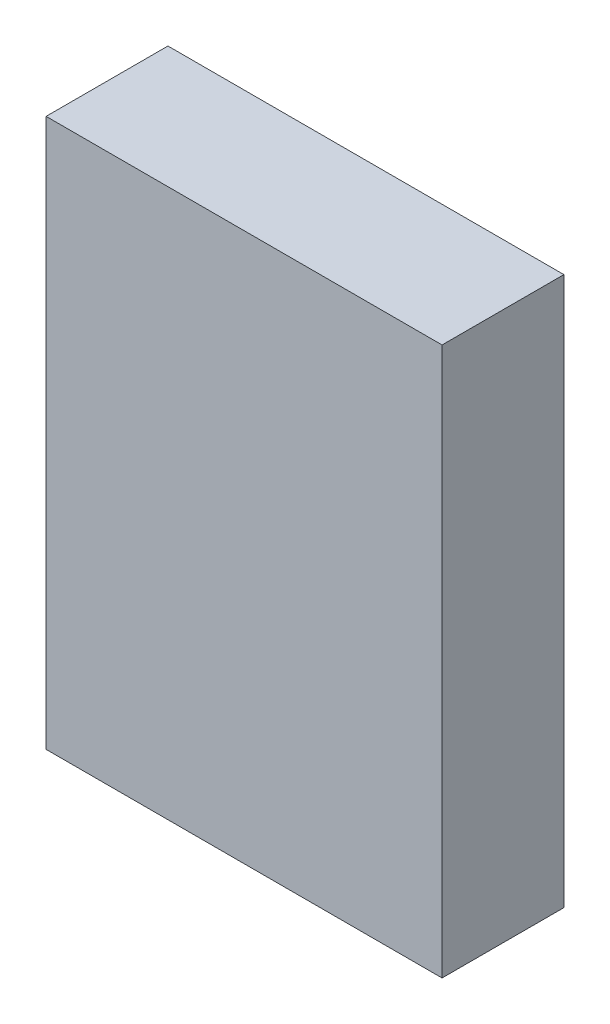
ISO-10303-21;
HEADER;
FILE_DESCRIPTION(('STEP AP214'),'2;1');
FILE_NAME('part.step','',(''),(''),'','','');
FILE_SCHEMA(('AUTOMOTIVE_DESIGN { 1 0 10303 214 1 1 1 1 }'));
ENDSEC;
DATA;
#1=APPLICATION_CONTEXT('core data for automotive mechanical design processes');
#2=APPLICATION_PROTOCOL_DEFINITION('international standard','automotive_design',2000,#1);
#3=PRODUCT_CONTEXT('',#1,'mechanical');
#4=PRODUCT('Part','Part','',(#3));
#5=PRODUCT_RELATED_PRODUCT_CATEGORY('part','',(#4));
#6=PRODUCT_DEFINITION_FORMATION('','',#4);
#7=PRODUCT_DEFINITION_CONTEXT('part definition',#1,'design');
#8=PRODUCT_DEFINITION('design','',#6,#7);
#9=PRODUCT_DEFINITION_SHAPE('','',#8);
#10=(LENGTH_UNIT() NAMED_UNIT(*) SI_UNIT(.MILLI.,.METRE.));
#11=(NAMED_UNIT(*) PLANE_ANGLE_UNIT() SI_UNIT($,.RADIAN.));
#12=(NAMED_UNIT(*) SI_UNIT($,.STERADIAN.) SOLID_ANGLE_UNIT());
#13=UNCERTAINTY_MEASURE_WITH_UNIT(LENGTH_MEASURE(1.E-05),#10,'distance_accuracy_value','');
#14=(GEOMETRIC_REPRESENTATION_CONTEXT(3) GLOBAL_UNCERTAINTY_ASSIGNED_CONTEXT((#13)) GLOBAL_UNIT_ASSIGNED_CONTEXT((#10,
#11,#12)) REPRESENTATION_CONTEXT('',''));
#15=CARTESIAN_POINT('',(0.,0.,0.));
#16=DIRECTION('',(0.,0.,1.));
#17=DIRECTION('',(1.,0.,0.));
#18=AXIS2_PLACEMENT_3D('',#15,#16,#17);
#19=CARTESIAN_POINT('',(-5.66292134831461,10.8455056179775,6.));
#20=DIRECTION('',(1.,0.,0.));
#21=DIRECTION('',(0.,0.,-1.));
#22=AXIS2_PLACEMENT_3D('',#19,#20,#21);
#23=PLANE('',#22);
#24=DIRECTION('',(0.,-1.,0.));
#25=VECTOR('',#24,1.);
#26=CARTESIAN_POINT('',(-5.66292134831461,10.8455056179775,0.));
#27=LINE('',#26,#25);
#28=CARTESIAN_POINT('',(-5.66292134831461,10.8455056179775,0.));
#29=VERTEX_POINT('',#28);
#30=CARTESIAN_POINT('',(-5.66292134831461,-16.1544943820225,0.));
#31=VERTEX_POINT('',#30);
#32=EDGE_CURVE('E96',#29,#31,#27,.T.);
#33=ORIENTED_EDGE('',*,*,#32,.T.);
#34=DIRECTION('',(0.,0.,-1.));
#35=VECTOR('',#34,1.);
#36=CARTESIAN_POINT('',(-5.66292134831461,-16.1544943820225,6.));
#37=LINE('',#36,#35);
#38=CARTESIAN_POINT('',(-5.66292134831461,-16.1544943820225,6.));
#39=VERTEX_POINT('',#38);
#40=EDGE_CURVE('E11',#39,#31,#37,.T.);
#41=ORIENTED_EDGE('',*,*,#40,.F.);
#42=DIRECTION('',(0.,-1.,0.));
#43=VECTOR('',#42,1.);
#44=CARTESIAN_POINT('',(-5.66292134831461,10.8455056179775,6.));
#45=LINE('',#44,#43);
#46=CARTESIAN_POINT('',(-5.66292134831461,10.8455056179775,6.));
#47=VERTEX_POINT('',#46);
#48=EDGE_CURVE('E84',#47,#39,#45,.T.);
#49=ORIENTED_EDGE('',*,*,#48,.F.);
#50=DIRECTION('',(0.,0.,-1.));
#51=VECTOR('',#50,1.);
#52=CARTESIAN_POINT('',(-5.66292134831461,10.8455056179775,6.));
#53=LINE('',#52,#51);
#54=EDGE_CURVE('E92',#47,#29,#53,.T.);
#55=ORIENTED_EDGE('',*,*,#54,.T.);
#56=EDGE_LOOP('',(#33,#41,#49,#55));
#57=FACE_BOUND('',#56,.T.);
#58=ADVANCED_FACE('F33',(#57),#23,.F.);
#59=CARTESIAN_POINT('',(-5.66292134831461,-16.1544943820225,6.));
#60=DIRECTION('',(0.,1.,0.));
#61=DIRECTION('',(-1.,0.,0.));
#62=AXIS2_PLACEMENT_3D('',#59,#60,#61);
#63=PLANE('',#62);
#64=DIRECTION('',(1.,0.,0.));
#65=VECTOR('',#64,1.);
#66=CARTESIAN_POINT('',(-5.66292134831461,-16.1544943820225,0.));
#67=LINE('',#66,#65);
#68=CARTESIAN_POINT('',(13.8370786516854,-16.1544943820225,0.));
#69=VERTEX_POINT('',#68);
#70=EDGE_CURVE('E88',#31,#69,#67,.T.);
#71=ORIENTED_EDGE('',*,*,#70,.T.);
#72=DIRECTION('',(0.,0.,-1.));
#73=VECTOR('',#72,1.);
#74=CARTESIAN_POINT('',(13.8370786516854,-16.1544943820225,6.));
#75=LINE('',#74,#73);
#76=CARTESIAN_POINT('',(13.8370786516854,-16.1544943820225,6.));
#77=VERTEX_POINT('',#76);
#78=EDGE_CURVE('E41',#77,#69,#75,.T.);
#79=ORIENTED_EDGE('',*,*,#78,.F.);
#80=DIRECTION('',(1.,0.,0.));
#81=VECTOR('',#80,1.);
#82=CARTESIAN_POINT('',(-5.66292134831461,-16.1544943820225,6.));
#83=LINE('',#82,#81);
#84=EDGE_CURVE('E79',#39,#77,#83,.T.);
#85=ORIENTED_EDGE('',*,*,#84,.F.);
#86=ORIENTED_EDGE('',*,*,#40,.T.);
#87=EDGE_LOOP('',(#71,#79,#85,#86));
#88=FACE_BOUND('',#87,.T.);
#89=ADVANCED_FACE('F87',(#88),#63,.F.);
#90=CARTESIAN_POINT('',(13.8370786516854,10.8455056179775,6.));
#91=DIRECTION('',(-1.,0.,0.));
#92=DIRECTION('',(0.,-1.,0.));
#93=AXIS2_PLACEMENT_3D('',#90,#91,#92);
#94=PLANE('',#93);
#95=DIRECTION('',(0.,1.,0.));
#96=VECTOR('',#95,1.);
#97=CARTESIAN_POINT('',(13.8370786516854,10.8455056179775,0.));
#98=LINE('',#97,#96);
#99=CARTESIAN_POINT('',(13.8370786516854,10.8455056179775,0.));
#100=VERTEX_POINT('',#99);
#101=EDGE_CURVE('E66',#69,#100,#98,.T.);
#102=ORIENTED_EDGE('',*,*,#101,.T.);
#103=DIRECTION('',(0.,0.,-1.));
#104=VECTOR('',#103,1.);
#105=CARTESIAN_POINT('',(13.8370786516854,10.8455056179775,6.));
#106=LINE('',#105,#104);
#107=CARTESIAN_POINT('',(13.8370786516854,10.8455056179775,6.));
#108=VERTEX_POINT('',#107);
#109=EDGE_CURVE('E89',#108,#100,#106,.T.);
#110=ORIENTED_EDGE('',*,*,#109,.F.);
#111=DIRECTION('',(0.,1.,0.));
#112=VECTOR('',#111,1.);
#113=CARTESIAN_POINT('',(13.8370786516854,10.8455056179775,6.));
#114=LINE('',#113,#112);
#115=EDGE_CURVE('E82',#77,#108,#114,.T.);
#116=ORIENTED_EDGE('',*,*,#115,.F.);
#117=ORIENTED_EDGE('',*,*,#78,.T.);
#118=EDGE_LOOP('',(#102,#110,#116,#117));
#119=FACE_BOUND('',#118,.T.);
#120=ADVANCED_FACE('F90',(#119),#94,.F.);
#121=CARTESIAN_POINT('',(-5.66292134831461,10.8455056179775,6.));
#122=DIRECTION('',(0.,-1.,0.));
#123=DIRECTION('',(0.,0.,-1.));
#124=AXIS2_PLACEMENT_3D('',#121,#122,#123);
#125=PLANE('',#124);
#126=DIRECTION('',(-1.,0.,0.));
#127=VECTOR('',#126,1.);
#128=CARTESIAN_POINT('',(-5.66292134831461,10.8455056179775,0.));
#129=LINE('',#128,#127);
#130=EDGE_CURVE('E72',#100,#29,#129,.T.);
#131=ORIENTED_EDGE('',*,*,#130,.T.);
#132=ORIENTED_EDGE('',*,*,#54,.F.);
#133=DIRECTION('',(-1.,0.,0.));
#134=VECTOR('',#133,1.);
#135=CARTESIAN_POINT('',(-5.66292134831461,10.8455056179775,6.));
#136=LINE('',#135,#134);
#137=EDGE_CURVE('E49',#108,#47,#136,.T.);
#138=ORIENTED_EDGE('',*,*,#137,.F.);
#139=ORIENTED_EDGE('',*,*,#109,.T.);
#140=EDGE_LOOP('',(#131,#132,#138,#139));
#141=FACE_BOUND('',#140,.T.);
#142=ADVANCED_FACE('F103',(#141),#125,.F.);
#143=CARTESIAN_POINT('',(0.,0.,6.));
#144=DIRECTION('',(0.,0.,1.));
#145=DIRECTION('',(1.,0.,0.));
#146=AXIS2_PLACEMENT_3D('',#143,#144,#145);
#147=PLANE('',#146);
#148=ORIENTED_EDGE('',*,*,#48,.T.);
#149=ORIENTED_EDGE('',*,*,#84,.T.);
#150=ORIENTED_EDGE('',*,*,#115,.T.);
#151=ORIENTED_EDGE('',*,*,#137,.T.);
#152=EDGE_LOOP('',(#148,#149,#150,#151));
#153=FACE_BOUND('',#152,.T.);
#154=ADVANCED_FACE('F80',(#153),#147,.T.);
#155=CARTESIAN_POINT('',(0.,0.,0.));
#156=DIRECTION('',(0.,0.,1.));
#157=DIRECTION('',(1.,0.,0.));
#158=AXIS2_PLACEMENT_3D('',#155,#156,#157);
#159=PLANE('',#158);
#160=ORIENTED_EDGE('',*,*,#32,.F.);
#161=ORIENTED_EDGE('',*,*,#130,.F.);
#162=ORIENTED_EDGE('',*,*,#101,.F.);
#163=ORIENTED_EDGE('',*,*,#70,.F.);
#164=EDGE_LOOP('',(#160,#161,#162,#163));
#165=FACE_BOUND('',#164,.T.);
#166=ADVANCED_FACE('F106',(#165),#159,.F.);
#167=CLOSED_SHELL('',(#58,#89,#120,#142,#154,#166));
#168=MANIFOLD_SOLID_BREP('B2',#167);
#169=ADVANCED_BREP_SHAPE_REPRESENTATION('',(#18,#168),#14);
#170=SHAPE_DEFINITION_REPRESENTATION(#9,#169);
ENDSEC;
END-ISO-10303-21;
